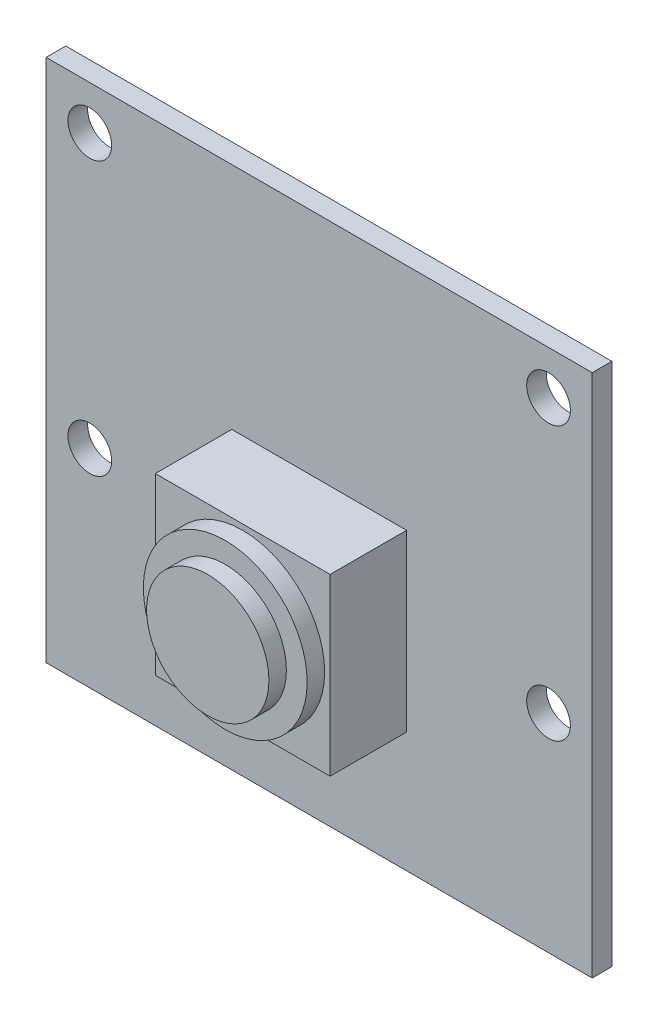
ISO-10303-21;
HEADER;
FILE_DESCRIPTION(('STEP AP214'),'2;1');
FILE_NAME('part.step','',(''),(''),'','','');
FILE_SCHEMA(('AUTOMOTIVE_DESIGN { 1 0 10303 214 1 1 1 1 }'));
ENDSEC;
DATA;
#1=APPLICATION_CONTEXT('core data for automotive mechanical design processes');
#2=APPLICATION_PROTOCOL_DEFINITION('international standard','automotive_design',2000,#1);
#3=PRODUCT_CONTEXT('',#1,'mechanical');
#4=PRODUCT('Part','Part','',(#3));
#5=PRODUCT_RELATED_PRODUCT_CATEGORY('part','',(#4));
#6=PRODUCT_DEFINITION_FORMATION('','',#4);
#7=PRODUCT_DEFINITION_CONTEXT('part definition',#1,'design');
#8=PRODUCT_DEFINITION('design','',#6,#7);
#9=PRODUCT_DEFINITION_SHAPE('','',#8);
#10=(LENGTH_UNIT() NAMED_UNIT(*) SI_UNIT(.MILLI.,.METRE.));
#11=(NAMED_UNIT(*) PLANE_ANGLE_UNIT() SI_UNIT($,.RADIAN.));
#12=(NAMED_UNIT(*) SI_UNIT($,.STERADIAN.) SOLID_ANGLE_UNIT());
#13=UNCERTAINTY_MEASURE_WITH_UNIT(LENGTH_MEASURE(1.E-05),#10,'distance_accuracy_value','');
#14=(GEOMETRIC_REPRESENTATION_CONTEXT(3) GLOBAL_UNCERTAINTY_ASSIGNED_CONTEXT((#13)) GLOBAL_UNIT_ASSIGNED_CONTEXT((#10,
#11,#12)) REPRESENTATION_CONTEXT('',''));
#15=CARTESIAN_POINT('',(0.,0.,0.));
#16=DIRECTION('',(0.,0.,1.));
#17=DIRECTION('',(1.,0.,0.));
#18=AXIS2_PLACEMENT_3D('',#15,#16,#17);
#19=CARTESIAN_POINT('',(0.,-2.50000000000001,5.2));
#20=DIRECTION('',(0.,0.,1.));
#21=DIRECTION('',(1.,0.,0.));
#22=AXIS2_PLACEMENT_3D('',#19,#20,#21);
#23=PLANE('',#22);
#24=CARTESIAN_POINT('',(0.,-2.50000000000001,5.2));
#25=DIRECTION('',(0.,0.,1.));
#26=DIRECTION('',(1.,0.,0.));
#27=AXIS2_PLACEMENT_3D('',#24,#25,#26);
#28=CIRCLE('',#27,3.75);
#29=CARTESIAN_POINT('',(3.75,-2.50000000000001,5.2));
#30=VERTEX_POINT('',#29);
#31=EDGE_CURVE('E366',#30,#30,#28,.T.);
#32=ORIENTED_EDGE('',*,*,#31,.T.);
#33=EDGE_LOOP('',(#32));
#34=FACE_BOUND('',#33,.T.);
#35=CARTESIAN_POINT('',(0.,-2.50000000000001,5.2));
#36=DIRECTION('',(0.,0.,1.));
#37=DIRECTION('',(1.,0.,0.));
#38=AXIS2_PLACEMENT_3D('',#35,#36,#37);
#39=CIRCLE('',#38,2.8);
#40=CARTESIAN_POINT('',(2.8,-2.50000000000001,5.2));
#41=VERTEX_POINT('',#40);
#42=EDGE_CURVE('E363',#41,#41,#39,.T.);
#43=ORIENTED_EDGE('',*,*,#42,.F.);
#44=EDGE_LOOP('',(#43));
#45=FACE_BOUND('',#44,.T.);
#46=ADVANCED_FACE('F31',(#34,#45),#23,.T.);
#47=CARTESIAN_POINT('',(-4.,1.5,4.4));
#48=DIRECTION('',(0.,0.,1.));
#49=DIRECTION('',(1.,0.,0.));
#50=AXIS2_PLACEMENT_3D('',#47,#48,#49);
#51=PLANE('',#50);
#52=DIRECTION('',(0.,-1.,0.));
#53=VECTOR('',#52,1.);
#54=CARTESIAN_POINT('',(-4.,-6.50000000000001,4.4));
#55=LINE('',#54,#53);
#56=CARTESIAN_POINT('',(-4.,1.5,4.4));
#57=VERTEX_POINT('',#56);
#58=CARTESIAN_POINT('',(-4.,-6.50000000000001,4.4));
#59=VERTEX_POINT('',#58);
#60=EDGE_CURVE('E116',#57,#59,#55,.T.);
#61=ORIENTED_EDGE('',*,*,#60,.T.);
#62=DIRECTION('',(1.,0.,0.));
#63=VECTOR('',#62,1.);
#64=CARTESIAN_POINT('',(4.,-6.5,4.4));
#65=LINE('',#64,#63);
#66=CARTESIAN_POINT('',(4.,-6.5,4.4));
#67=VERTEX_POINT('',#66);
#68=EDGE_CURVE('E105',#59,#67,#65,.T.);
#69=ORIENTED_EDGE('',*,*,#68,.T.);
#70=DIRECTION('',(0.,1.,0.));
#71=VECTOR('',#70,1.);
#72=CARTESIAN_POINT('',(4.,-6.5,4.4));
#73=LINE('',#72,#71);
#74=CARTESIAN_POINT('',(4.,1.5,4.4));
#75=VERTEX_POINT('',#74);
#76=EDGE_CURVE('E115',#67,#75,#73,.T.);
#77=ORIENTED_EDGE('',*,*,#76,.T.);
#78=DIRECTION('',(-1.,0.,0.));
#79=VECTOR('',#78,1.);
#80=CARTESIAN_POINT('',(4.,1.5,4.4));
#81=LINE('',#80,#79);
#82=EDGE_CURVE('E121',#75,#57,#81,.T.);
#83=ORIENTED_EDGE('',*,*,#82,.T.);
#84=EDGE_LOOP('',(#61,#69,#77,#83));
#85=FACE_BOUND('',#84,.T.);
#86=CARTESIAN_POINT('',(0.,-2.50000000000001,4.4));
#87=DIRECTION('',(0.,0.,1.));
#88=DIRECTION('',(1.,0.,0.));
#89=AXIS2_PLACEMENT_3D('',#86,#87,#88);
#90=CIRCLE('',#89,3.75);
#91=CARTESIAN_POINT('',(3.75,-2.50000000000001,4.4));
#92=VERTEX_POINT('',#91);
#93=EDGE_CURVE('E362',#92,#92,#90,.T.);
#94=ORIENTED_EDGE('',*,*,#93,.F.);
#95=EDGE_LOOP('',(#94));
#96=FACE_BOUND('',#95,.T.);
#97=ADVANCED_FACE('F119',(#85,#96),#51,.T.);
#98=CARTESIAN_POINT('',(-12.5,12.,0.9));
#99=DIRECTION('',(0.,0.,1.));
#100=DIRECTION('',(1.,0.,0.));
#101=AXIS2_PLACEMENT_3D('',#98,#99,#100);
#102=PLANE('',#101);
#103=CARTESIAN_POINT('',(-10.5,9.99999999999999,0.9));
#104=DIRECTION('',(0.,0.,1.));
#105=DIRECTION('',(1.,0.,0.));
#106=AXIS2_PLACEMENT_3D('',#103,#104,#105);
#107=CIRCLE('',#106,1.);
#108=CARTESIAN_POINT('',(-9.49999999999999,9.99999999999999,0.9));
#109=VERTEX_POINT('',#108);
#110=EDGE_CURVE('E134',#109,#109,#107,.T.);
#111=ORIENTED_EDGE('',*,*,#110,.F.);
#112=EDGE_LOOP('',(#111));
#113=FACE_BOUND('',#112,.T.);
#114=CARTESIAN_POINT('',(10.5,-2.50000000000001,0.9));
#115=DIRECTION('',(0.,0.,1.));
#116=DIRECTION('',(1.,0.,0.));
#117=AXIS2_PLACEMENT_3D('',#114,#115,#116);
#118=CIRCLE('',#117,1.);
#119=CARTESIAN_POINT('',(11.5,-2.50000000000001,0.9));
#120=VERTEX_POINT('',#119);
#121=EDGE_CURVE('E148',#120,#120,#118,.T.);
#122=ORIENTED_EDGE('',*,*,#121,.F.);
#123=EDGE_LOOP('',(#122));
#124=FACE_BOUND('',#123,.T.);
#125=DIRECTION('',(0.,-1.,0.));
#126=VECTOR('',#125,1.);
#127=CARTESIAN_POINT('',(-12.5,-12.,0.9));
#128=LINE('',#127,#126);
#129=CARTESIAN_POINT('',(-12.5,12.,0.9));
#130=VERTEX_POINT('',#129);
#131=CARTESIAN_POINT('',(-12.5,-12.,0.9));
#132=VERTEX_POINT('',#131);
#133=EDGE_CURVE('E160',#130,#132,#128,.T.);
#134=ORIENTED_EDGE('',*,*,#133,.T.);
#135=DIRECTION('',(1.,0.,0.));
#136=VECTOR('',#135,1.);
#137=CARTESIAN_POINT('',(12.5,-12.,0.9));
#138=LINE('',#137,#136);
#139=CARTESIAN_POINT('',(12.5,-12.,0.9));
#140=VERTEX_POINT('',#139);
#141=EDGE_CURVE('E83',#132,#140,#138,.T.);
#142=ORIENTED_EDGE('',*,*,#141,.T.);
#143=DIRECTION('',(0.,1.,0.));
#144=VECTOR('',#143,1.);
#145=CARTESIAN_POINT('',(12.5,-12.,0.9));
#146=LINE('',#145,#144);
#147=CARTESIAN_POINT('',(12.5,12.,0.9));
#148=VERTEX_POINT('',#147);
#149=EDGE_CURVE('E163',#140,#148,#146,.T.);
#150=ORIENTED_EDGE('',*,*,#149,.T.);
#151=DIRECTION('',(-1.,0.,0.));
#152=VECTOR('',#151,1.);
#153=CARTESIAN_POINT('',(12.5,12.,0.9));
#154=LINE('',#153,#152);
#155=EDGE_CURVE('E55',#148,#130,#154,.T.);
#156=ORIENTED_EDGE('',*,*,#155,.T.);
#157=EDGE_LOOP('',(#134,#142,#150,#156));
#158=FACE_BOUND('',#157,.T.);
#159=CARTESIAN_POINT('',(10.5,9.99999999999999,0.9));
#160=DIRECTION('',(0.,0.,1.));
#161=DIRECTION('',(1.,0.,0.));
#162=AXIS2_PLACEMENT_3D('',#159,#160,#161);
#163=CIRCLE('',#162,1.);
#164=CARTESIAN_POINT('',(11.5,9.99999999999999,0.9));
#165=VERTEX_POINT('',#164);
#166=EDGE_CURVE('E154',#165,#165,#163,.T.);
#167=ORIENTED_EDGE('',*,*,#166,.F.);
#168=EDGE_LOOP('',(#167));
#169=FACE_BOUND('',#168,.T.);
#170=CARTESIAN_POINT('',(-10.5,-2.50000000000001,0.9));
#171=DIRECTION('',(0.,0.,1.));
#172=DIRECTION('',(1.,0.,0.));
#173=AXIS2_PLACEMENT_3D('',#170,#171,#172);
#174=CIRCLE('',#173,1.);
#175=CARTESIAN_POINT('',(-9.49999999999999,-2.50000000000001,0.9));
#176=VERTEX_POINT('',#175);
#177=EDGE_CURVE('E142',#176,#176,#174,.T.);
#178=ORIENTED_EDGE('',*,*,#177,.F.);
#179=EDGE_LOOP('',(#178));
#180=FACE_BOUND('',#179,.T.);
#181=DIRECTION('',(1.,0.,0.));
#182=VECTOR('',#181,1.);
#183=CARTESIAN_POINT('',(4.,-6.5,0.9));
#184=LINE('',#183,#182);
#185=CARTESIAN_POINT('',(-4.,-6.50000000000001,0.9));
#186=VERTEX_POINT('',#185);
#187=CARTESIAN_POINT('',(4.,-6.5,0.9));
#188=VERTEX_POINT('',#187);
#189=EDGE_CURVE('E376',#186,#188,#184,.T.);
#190=ORIENTED_EDGE('',*,*,#189,.F.);
#191=DIRECTION('',(0.,-1.,0.));
#192=VECTOR('',#191,1.);
#193=CARTESIAN_POINT('',(-4.,-6.50000000000001,0.9));
#194=LINE('',#193,#192);
#195=CARTESIAN_POINT('',(-4.,1.5,0.9));
#196=VERTEX_POINT('',#195);
#197=EDGE_CURVE('E129',#196,#186,#194,.T.);
#198=ORIENTED_EDGE('',*,*,#197,.F.);
#199=DIRECTION('',(-1.,0.,0.));
#200=VECTOR('',#199,1.);
#201=CARTESIAN_POINT('',(4.,1.5,0.9));
#202=LINE('',#201,#200);
#203=CARTESIAN_POINT('',(4.,1.5,0.9));
#204=VERTEX_POINT('',#203);
#205=EDGE_CURVE('E125',#204,#196,#202,.T.);
#206=ORIENTED_EDGE('',*,*,#205,.F.);
#207=DIRECTION('',(0.,1.,0.));
#208=VECTOR('',#207,1.);
#209=CARTESIAN_POINT('',(4.,-6.5,0.9));
#210=LINE('',#209,#208);
#211=EDGE_CURVE('E378',#188,#204,#210,.T.);
#212=ORIENTED_EDGE('',*,*,#211,.F.);
#213=EDGE_LOOP('',(#190,#198,#206,#212));
#214=FACE_BOUND('',#213,.T.);
#215=ADVANCED_FACE('F209',(#113,#124,#158,#169,#180,#214),#102,.T.);
#216=CARTESIAN_POINT('',(-12.5,12.,0.));
#217=DIRECTION('',(0.,0.,1.));
#218=DIRECTION('',(1.,0.,0.));
#219=AXIS2_PLACEMENT_3D('',#216,#217,#218);
#220=PLANE('',#219);
#221=CARTESIAN_POINT('',(-10.5,-2.50000000000001,0.));
#222=DIRECTION('',(0.,0.,1.));
#223=DIRECTION('',(1.,0.,0.));
#224=AXIS2_PLACEMENT_3D('',#221,#222,#223);
#225=CIRCLE('',#224,1.);
#226=CARTESIAN_POINT('',(-9.49999999999999,-2.50000000000001,0.));
#227=VERTEX_POINT('',#226);
#228=EDGE_CURVE('E140',#227,#227,#225,.T.);
#229=ORIENTED_EDGE('',*,*,#228,.T.);
#230=EDGE_LOOP('',(#229));
#231=FACE_BOUND('',#230,.T.);
#232=CARTESIAN_POINT('',(10.5,9.99999999999999,0.));
#233=DIRECTION('',(0.,0.,1.));
#234=DIRECTION('',(1.,0.,0.));
#235=AXIS2_PLACEMENT_3D('',#232,#233,#234);
#236=CIRCLE('',#235,1.);
#237=CARTESIAN_POINT('',(11.5,9.99999999999999,0.));
#238=VERTEX_POINT('',#237);
#239=EDGE_CURVE('E151',#238,#238,#236,.T.);
#240=ORIENTED_EDGE('',*,*,#239,.T.);
#241=EDGE_LOOP('',(#240));
#242=FACE_BOUND('',#241,.T.);
#243=DIRECTION('',(0.,-1.,0.));
#244=VECTOR('',#243,1.);
#245=CARTESIAN_POINT('',(-12.5,-12.,0.));
#246=LINE('',#245,#244);
#247=CARTESIAN_POINT('',(-12.5,12.,0.));
#248=VERTEX_POINT('',#247);
#249=CARTESIAN_POINT('',(-12.5,-12.,0.));
#250=VERTEX_POINT('',#249);
#251=EDGE_CURVE('E157',#248,#250,#246,.T.);
#252=ORIENTED_EDGE('',*,*,#251,.F.);
#253=DIRECTION('',(-1.,0.,0.));
#254=VECTOR('',#253,1.);
#255=CARTESIAN_POINT('',(12.5,12.,0.));
#256=LINE('',#255,#254);
#257=CARTESIAN_POINT('',(12.5,12.,0.));
#258=VERTEX_POINT('',#257);
#259=EDGE_CURVE('E76',#258,#248,#256,.T.);
#260=ORIENTED_EDGE('',*,*,#259,.F.);
#261=DIRECTION('',(0.,1.,0.));
#262=VECTOR('',#261,1.);
#263=CARTESIAN_POINT('',(12.5,-12.,0.));
#264=LINE('',#263,#262);
#265=CARTESIAN_POINT('',(12.5,-12.,0.));
#266=VERTEX_POINT('',#265);
#267=EDGE_CURVE('E171',#266,#258,#264,.T.);
#268=ORIENTED_EDGE('',*,*,#267,.F.);
#269=DIRECTION('',(1.,0.,0.));
#270=VECTOR('',#269,1.);
#271=CARTESIAN_POINT('',(12.5,-12.,0.));
#272=LINE('',#271,#270);
#273=EDGE_CURVE('E169',#250,#266,#272,.T.);
#274=ORIENTED_EDGE('',*,*,#273,.F.);
#275=EDGE_LOOP('',(#252,#260,#268,#274));
#276=FACE_BOUND('',#275,.T.);
#277=CARTESIAN_POINT('',(10.5,-2.50000000000001,0.));
#278=DIRECTION('',(0.,0.,1.));
#279=DIRECTION('',(1.,0.,0.));
#280=AXIS2_PLACEMENT_3D('',#277,#278,#279);
#281=CIRCLE('',#280,1.);
#282=CARTESIAN_POINT('',(11.5,-2.50000000000001,0.));
#283=VERTEX_POINT('',#282);
#284=EDGE_CURVE('E145',#283,#283,#281,.T.);
#285=ORIENTED_EDGE('',*,*,#284,.T.);
#286=EDGE_LOOP('',(#285));
#287=FACE_BOUND('',#286,.T.);
#288=CARTESIAN_POINT('',(-10.5,9.99999999999999,0.));
#289=DIRECTION('',(0.,0.,1.));
#290=DIRECTION('',(1.,0.,0.));
#291=AXIS2_PLACEMENT_3D('',#288,#289,#290);
#292=CIRCLE('',#291,1.);
#293=CARTESIAN_POINT('',(-9.49999999999999,9.99999999999999,0.));
#294=VERTEX_POINT('',#293);
#295=EDGE_CURVE('E131',#294,#294,#292,.T.);
#296=ORIENTED_EDGE('',*,*,#295,.T.);
#297=EDGE_LOOP('',(#296));
#298=FACE_BOUND('',#297,.T.);
#299=ADVANCED_FACE('F184',(#231,#242,#276,#287,#298),#220,.F.);
#300=CARTESIAN_POINT('',(-12.5,-12.,0.9));
#301=DIRECTION('',(1.,0.,0.));
#302=DIRECTION('',(0.,0.,-1.));
#303=AXIS2_PLACEMENT_3D('',#300,#301,#302);
#304=PLANE('',#303);
#305=ORIENTED_EDGE('',*,*,#251,.T.);
#306=DIRECTION('',(0.,0.,-1.));
#307=VECTOR('',#306,1.);
#308=CARTESIAN_POINT('',(-12.5,-12.,0.9));
#309=LINE('',#308,#307);
#310=EDGE_CURVE('E11',#132,#250,#309,.T.);
#311=ORIENTED_EDGE('',*,*,#310,.F.);
#312=ORIENTED_EDGE('',*,*,#133,.F.);
#313=DIRECTION('',(0.,0.,-1.));
#314=VECTOR('',#313,1.);
#315=CARTESIAN_POINT('',(-12.5,12.,0.9));
#316=LINE('',#315,#314);
#317=EDGE_CURVE('E166',#130,#248,#316,.T.);
#318=ORIENTED_EDGE('',*,*,#317,.T.);
#319=EDGE_LOOP('',(#305,#311,#312,#318));
#320=FACE_BOUND('',#319,.T.);
#321=ADVANCED_FACE('F33',(#320),#304,.F.);
#322=CARTESIAN_POINT('',(12.5,-12.,0.9));
#323=DIRECTION('',(0.,1.,0.));
#324=DIRECTION('',(0.,0.,1.));
#325=AXIS2_PLACEMENT_3D('',#322,#323,#324);
#326=PLANE('',#325);
#327=ORIENTED_EDGE('',*,*,#273,.T.);
#328=DIRECTION('',(0.,0.,-1.));
#329=VECTOR('',#328,1.);
#330=CARTESIAN_POINT('',(12.5,-12.,0.9));
#331=LINE('',#330,#329);
#332=EDGE_CURVE('E39',#140,#266,#331,.T.);
#333=ORIENTED_EDGE('',*,*,#332,.F.);
#334=ORIENTED_EDGE('',*,*,#141,.F.);
#335=ORIENTED_EDGE('',*,*,#310,.T.);
#336=EDGE_LOOP('',(#327,#333,#334,#335));
#337=FACE_BOUND('',#336,.T.);
#338=ADVANCED_FACE('F200',(#337),#326,.F.);
#339=CARTESIAN_POINT('',(12.5,-12.,0.9));
#340=DIRECTION('',(-1.,0.,0.));
#341=DIRECTION('',(0.,0.,1.));
#342=AXIS2_PLACEMENT_3D('',#339,#340,#341);
#343=PLANE('',#342);
#344=ORIENTED_EDGE('',*,*,#267,.T.);
#345=DIRECTION('',(0.,0.,-1.));
#346=VECTOR('',#345,1.);
#347=CARTESIAN_POINT('',(12.5,12.,0.9));
#348=LINE('',#347,#346);
#349=EDGE_CURVE('E175',#148,#258,#348,.T.);
#350=ORIENTED_EDGE('',*,*,#349,.F.);
#351=ORIENTED_EDGE('',*,*,#149,.F.);
#352=ORIENTED_EDGE('',*,*,#332,.T.);
#353=EDGE_LOOP('',(#344,#350,#351,#352));
#354=FACE_BOUND('',#353,.T.);
#355=ADVANCED_FACE('F180',(#354),#343,.F.);
#356=CARTESIAN_POINT('',(12.5,12.,0.9));
#357=DIRECTION('',(0.,-1.,0.));
#358=DIRECTION('',(0.,0.,-1.));
#359=AXIS2_PLACEMENT_3D('',#356,#357,#358);
#360=PLANE('',#359);
#361=ORIENTED_EDGE('',*,*,#259,.T.);
#362=ORIENTED_EDGE('',*,*,#317,.F.);
#363=ORIENTED_EDGE('',*,*,#155,.F.);
#364=ORIENTED_EDGE('',*,*,#349,.T.);
#365=EDGE_LOOP('',(#361,#362,#363,#364));
#366=FACE_BOUND('',#365,.T.);
#367=ADVANCED_FACE('F189',(#366),#360,.F.);
#368=CARTESIAN_POINT('',(10.5,9.99999999999999,0.9));
#369=DIRECTION('',(0.,0.,-1.));
#370=DIRECTION('',(-1.,0.,0.));
#371=AXIS2_PLACEMENT_3D('',#368,#369,#370);
#372=CYLINDRICAL_SURFACE('',#371,1.);
#373=ORIENTED_EDGE('',*,*,#166,.T.);
#374=EDGE_LOOP('',(#373));
#375=FACE_BOUND('',#374,.T.);
#376=ORIENTED_EDGE('',*,*,#239,.F.);
#377=EDGE_LOOP('',(#376));
#378=FACE_BOUND('',#377,.T.);
#379=ADVANCED_FACE('F191',(#375,#378),#372,.F.);
#380=CARTESIAN_POINT('',(10.5,-2.50000000000001,0.9));
#381=DIRECTION('',(0.,0.,-1.));
#382=DIRECTION('',(-1.,0.,0.));
#383=AXIS2_PLACEMENT_3D('',#380,#381,#382);
#384=CYLINDRICAL_SURFACE('',#383,1.);
#385=ORIENTED_EDGE('',*,*,#121,.T.);
#386=EDGE_LOOP('',(#385));
#387=FACE_BOUND('',#386,.T.);
#388=ORIENTED_EDGE('',*,*,#284,.F.);
#389=EDGE_LOOP('',(#388));
#390=FACE_BOUND('',#389,.T.);
#391=ADVANCED_FACE('F197',(#387,#390),#384,.F.);
#392=CARTESIAN_POINT('',(-10.5,-2.50000000000001,0.9));
#393=DIRECTION('',(0.,0.,-1.));
#394=DIRECTION('',(-1.,0.,0.));
#395=AXIS2_PLACEMENT_3D('',#392,#393,#394);
#396=CYLINDRICAL_SURFACE('',#395,1.);
#397=ORIENTED_EDGE('',*,*,#177,.T.);
#398=EDGE_LOOP('',(#397));
#399=FACE_BOUND('',#398,.T.);
#400=ORIENTED_EDGE('',*,*,#228,.F.);
#401=EDGE_LOOP('',(#400));
#402=FACE_BOUND('',#401,.T.);
#403=ADVANCED_FACE('F235',(#399,#402),#396,.F.);
#404=CARTESIAN_POINT('',(-10.5,9.99999999999999,0.9));
#405=DIRECTION('',(0.,0.,-1.));
#406=DIRECTION('',(-1.,0.,0.));
#407=AXIS2_PLACEMENT_3D('',#404,#405,#406);
#408=CYLINDRICAL_SURFACE('',#407,1.);
#409=ORIENTED_EDGE('',*,*,#110,.T.);
#410=EDGE_LOOP('',(#409));
#411=FACE_BOUND('',#410,.T.);
#412=ORIENTED_EDGE('',*,*,#295,.F.);
#413=EDGE_LOOP('',(#412));
#414=FACE_BOUND('',#413,.T.);
#415=ADVANCED_FACE('F232',(#411,#414),#408,.F.);
#416=CARTESIAN_POINT('',(-4.,-6.50000000000001,4.4));
#417=DIRECTION('',(1.,0.,0.));
#418=DIRECTION('',(0.,1.,0.));
#419=AXIS2_PLACEMENT_3D('',#416,#417,#418);
#420=PLANE('',#419);
#421=ORIENTED_EDGE('',*,*,#197,.T.);
#422=DIRECTION('',(0.,0.,-1.));
#423=VECTOR('',#422,1.);
#424=CARTESIAN_POINT('',(-4.,-6.50000000000001,4.4));
#425=LINE('',#424,#423);
#426=EDGE_CURVE('E109',#59,#186,#425,.T.);
#427=ORIENTED_EDGE('',*,*,#426,.F.);
#428=ORIENTED_EDGE('',*,*,#60,.F.);
#429=DIRECTION('',(0.,0.,-1.));
#430=VECTOR('',#429,1.);
#431=CARTESIAN_POINT('',(-4.,1.5,4.4));
#432=LINE('',#431,#430);
#433=EDGE_CURVE('E374',#57,#196,#432,.T.);
#434=ORIENTED_EDGE('',*,*,#433,.T.);
#435=EDGE_LOOP('',(#421,#427,#428,#434));
#436=FACE_BOUND('',#435,.T.);
#437=ADVANCED_FACE('F127',(#436),#420,.F.);
#438=CARTESIAN_POINT('',(4.,-6.5,4.4));
#439=DIRECTION('',(0.,1.,0.));
#440=DIRECTION('',(-1.,0.,0.));
#441=AXIS2_PLACEMENT_3D('',#438,#439,#440);
#442=PLANE('',#441);
#443=ORIENTED_EDGE('',*,*,#189,.T.);
#444=DIRECTION('',(0.,0.,-1.));
#445=VECTOR('',#444,1.);
#446=CARTESIAN_POINT('',(4.,-6.5,4.4));
#447=LINE('',#446,#445);
#448=EDGE_CURVE('E112',#67,#188,#447,.T.);
#449=ORIENTED_EDGE('',*,*,#448,.F.);
#450=ORIENTED_EDGE('',*,*,#68,.F.);
#451=ORIENTED_EDGE('',*,*,#426,.T.);
#452=EDGE_LOOP('',(#443,#449,#450,#451));
#453=FACE_BOUND('',#452,.T.);
#454=ADVANCED_FACE('F107',(#453),#442,.F.);
#455=CARTESIAN_POINT('',(4.,-6.5,4.4));
#456=DIRECTION('',(-1.,0.,0.));
#457=DIRECTION('',(0.,0.,1.));
#458=AXIS2_PLACEMENT_3D('',#455,#456,#457);
#459=PLANE('',#458);
#460=ORIENTED_EDGE('',*,*,#211,.T.);
#461=DIRECTION('',(0.,0.,-1.));
#462=VECTOR('',#461,1.);
#463=CARTESIAN_POINT('',(4.,1.5,4.4));
#464=LINE('',#463,#462);
#465=EDGE_CURVE('E46',#75,#204,#464,.T.);
#466=ORIENTED_EDGE('',*,*,#465,.F.);
#467=ORIENTED_EDGE('',*,*,#76,.F.);
#468=ORIENTED_EDGE('',*,*,#448,.T.);
#469=EDGE_LOOP('',(#460,#466,#467,#468));
#470=FACE_BOUND('',#469,.T.);
#471=ADVANCED_FACE('F224',(#470),#459,.F.);
#472=CARTESIAN_POINT('',(4.,1.5,4.4));
#473=DIRECTION('',(0.,-1.,0.));
#474=DIRECTION('',(1.,0.,0.));
#475=AXIS2_PLACEMENT_3D('',#472,#473,#474);
#476=PLANE('',#475);
#477=ORIENTED_EDGE('',*,*,#205,.T.);
#478=ORIENTED_EDGE('',*,*,#433,.F.);
#479=ORIENTED_EDGE('',*,*,#82,.F.);
#480=ORIENTED_EDGE('',*,*,#465,.T.);
#481=EDGE_LOOP('',(#477,#478,#479,#480));
#482=FACE_BOUND('',#481,.T.);
#483=ADVANCED_FACE('F219',(#482),#476,.F.);
#484=CARTESIAN_POINT('',(0.,-2.50000000000001,5.2));
#485=DIRECTION('',(0.,0.,-1.));
#486=DIRECTION('',(-1.,0.,0.));
#487=AXIS2_PLACEMENT_3D('',#484,#485,#486);
#488=CYLINDRICAL_SURFACE('',#487,3.75);
#489=ORIENTED_EDGE('',*,*,#31,.F.);
#490=EDGE_LOOP('',(#489));
#491=FACE_BOUND('',#490,.T.);
#492=ORIENTED_EDGE('',*,*,#93,.T.);
#493=EDGE_LOOP('',(#492));
#494=FACE_BOUND('',#493,.T.);
#495=ADVANCED_FACE('F217',(#491,#494),#488,.T.);
#496=CARTESIAN_POINT('',(0.,-2.50000000000001,6.));
#497=DIRECTION('',(0.,0.,-1.));
#498=DIRECTION('',(-1.,0.,0.));
#499=AXIS2_PLACEMENT_3D('',#496,#497,#498);
#500=CYLINDRICAL_SURFACE('',#499,2.8);
#501=CARTESIAN_POINT('',(0.,-2.50000000000001,6.));
#502=DIRECTION('',(0.,0.,1.));
#503=DIRECTION('',(1.,0.,0.));
#504=AXIS2_PLACEMENT_3D('',#501,#502,#503);
#505=CIRCLE('',#504,2.8);
#506=CARTESIAN_POINT('',(2.8,-2.50000000000001,6.));
#507=VERTEX_POINT('',#506);
#508=EDGE_CURVE('E361',#507,#507,#505,.T.);
#509=ORIENTED_EDGE('',*,*,#508,.F.);
#510=EDGE_LOOP('',(#509));
#511=FACE_BOUND('',#510,.T.);
#512=ORIENTED_EDGE('',*,*,#42,.T.);
#513=EDGE_LOOP('',(#512));
#514=FACE_BOUND('',#513,.T.);
#515=ADVANCED_FACE('F215',(#511,#514),#500,.T.);
#516=CARTESIAN_POINT('',(0.,-2.50000000000001,6.));
#517=DIRECTION('',(0.,0.,1.));
#518=DIRECTION('',(1.,0.,0.));
#519=AXIS2_PLACEMENT_3D('',#516,#517,#518);
#520=PLANE('',#519);
#521=ORIENTED_EDGE('',*,*,#508,.T.);
#522=EDGE_LOOP('',(#521));
#523=FACE_BOUND('',#522,.T.);
#524=ADVANCED_FACE('F347',(#523),#520,.T.);
#525=CLOSED_SHELL('',(#46,#97,#215,#299,#321,#338,#355,#367,#379,#391,#403,#415,#437,#454,#471,
#483,#495,#515,#524));
#526=MANIFOLD_SOLID_BREP('B2',#525);
#527=ADVANCED_BREP_SHAPE_REPRESENTATION('',(#18,#526),#14);
#528=SHAPE_DEFINITION_REPRESENTATION(#9,#527);
ENDSEC;
END-ISO-10303-21;
